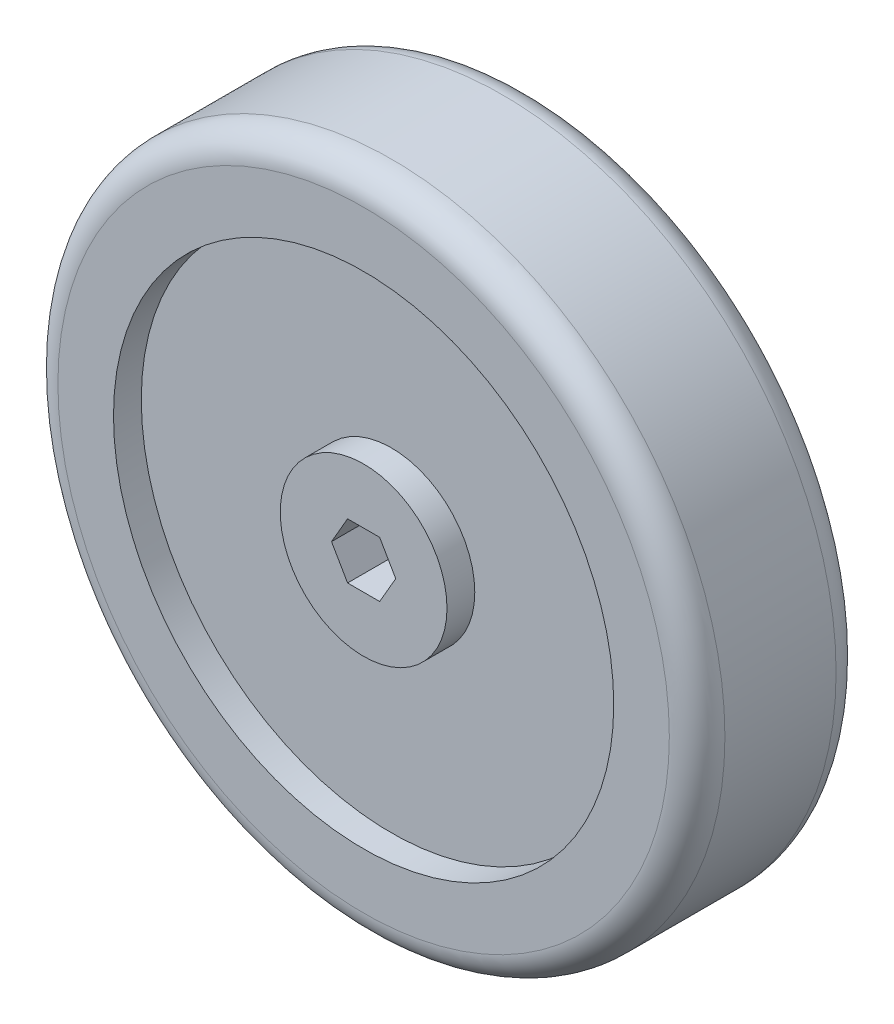
ISO-10303-21;
HEADER;
FILE_DESCRIPTION(('STEP AP214'),'2;1');
FILE_NAME('part.step','',(''),(''),'','','');
FILE_SCHEMA(('AUTOMOTIVE_DESIGN { 1 0 10303 214 1 1 1 1 }'));
ENDSEC;
DATA;
#1=APPLICATION_CONTEXT('core data for automotive mechanical design processes');
#2=APPLICATION_PROTOCOL_DEFINITION('international standard','automotive_design',2000,#1);
#3=PRODUCT_CONTEXT('',#1,'mechanical');
#4=PRODUCT('Part','Part','',(#3));
#5=PRODUCT_RELATED_PRODUCT_CATEGORY('part','',(#4));
#6=PRODUCT_DEFINITION_FORMATION('','',#4);
#7=PRODUCT_DEFINITION_CONTEXT('part definition',#1,'design');
#8=PRODUCT_DEFINITION('design','',#6,#7);
#9=PRODUCT_DEFINITION_SHAPE('','',#8);
#10=(LENGTH_UNIT() NAMED_UNIT(*) SI_UNIT(.MILLI.,.METRE.));
#11=(NAMED_UNIT(*) PLANE_ANGLE_UNIT() SI_UNIT($,.RADIAN.));
#12=(NAMED_UNIT(*) SI_UNIT($,.STERADIAN.) SOLID_ANGLE_UNIT());
#13=UNCERTAINTY_MEASURE_WITH_UNIT(LENGTH_MEASURE(1.E-05),#10,'distance_accuracy_value','');
#14=(GEOMETRIC_REPRESENTATION_CONTEXT(3) GLOBAL_UNCERTAINTY_ASSIGNED_CONTEXT((#13)) GLOBAL_UNIT_ASSIGNED_CONTEXT((#10,
#11,#12)) REPRESENTATION_CONTEXT('',''));
#15=CARTESIAN_POINT('',(0.,0.,0.));
#16=DIRECTION('',(0.,0.,1.));
#17=DIRECTION('',(1.,0.,0.));
#18=AXIS2_PLACEMENT_3D('',#15,#16,#17);
#19=CARTESIAN_POINT('',(0.,0.,0.));
#20=DIRECTION('',(0.,0.,1.));
#21=DIRECTION('',(1.,0.,0.));
#22=AXIS2_PLACEMENT_3D('',#19,#20,#21);
#23=PLANE('',#22);
#24=DIRECTION('',(1.,0.,0.));
#25=VECTOR('',#24,1.);
#26=CARTESIAN_POINT('',(-3.66617420935413,-6.35000000000001,0.));
#27=LINE('',#26,#25);
#28=CARTESIAN_POINT('',(-3.66617420935413,-6.35000000000001,0.));
#29=VERTEX_POINT('',#28);
#30=CARTESIAN_POINT('',(3.66617420935413,-6.35000000000001,0.));
#31=VERTEX_POINT('',#30);
#32=EDGE_CURVE('E95',#29,#31,#27,.T.);
#33=ORIENTED_EDGE('',*,*,#32,.T.);
#34=DIRECTION('',(0.5,0.866025403784439,0.));
#35=VECTOR('',#34,1.);
#36=CARTESIAN_POINT('',(3.66617420935413,-6.35000000000001,0.));
#37=LINE('',#36,#35);
#38=CARTESIAN_POINT('',(7.33234841870825,0.,0.));
#39=VERTEX_POINT('',#38);
#40=EDGE_CURVE('E89',#31,#39,#37,.T.);
#41=ORIENTED_EDGE('',*,*,#40,.T.);
#42=DIRECTION('',(-0.5,0.866025403784439,0.));
#43=VECTOR('',#42,1.);
#44=CARTESIAN_POINT('',(7.33234841870825,0.,0.));
#45=LINE('',#44,#43);
#46=CARTESIAN_POINT('',(3.66617420935412,6.35000000000001,0.));
#47=VERTEX_POINT('',#46);
#48=EDGE_CURVE('E98',#39,#47,#45,.T.);
#49=ORIENTED_EDGE('',*,*,#48,.T.);
#50=DIRECTION('',(-1.,0.,0.));
#51=VECTOR('',#50,1.);
#52=CARTESIAN_POINT('',(3.66617420935412,6.35000000000001,0.));
#53=LINE('',#52,#51);
#54=CARTESIAN_POINT('',(-3.66617420935413,6.35000000000001,0.));
#55=VERTEX_POINT('',#54);
#56=EDGE_CURVE('E57',#47,#55,#53,.T.);
#57=ORIENTED_EDGE('',*,*,#56,.T.);
#58=DIRECTION('',(-0.5,-0.866025403784439,0.));
#59=VECTOR('',#58,1.);
#60=CARTESIAN_POINT('',(-3.66617420935413,6.35000000000001,0.));
#61=LINE('',#60,#59);
#62=CARTESIAN_POINT('',(-7.33234841870826,0.,0.));
#63=VERTEX_POINT('',#62);
#64=EDGE_CURVE('E115',#55,#63,#61,.T.);
#65=ORIENTED_EDGE('',*,*,#64,.T.);
#66=DIRECTION('',(0.5,-0.866025403784439,0.));
#67=VECTOR('',#66,1.);
#68=CARTESIAN_POINT('',(-7.33234841870826,0.,0.));
#69=LINE('',#68,#67);
#70=EDGE_CURVE('E118',#63,#29,#69,.T.);
#71=ORIENTED_EDGE('',*,*,#70,.T.);
#72=EDGE_LOOP('',(#33,#41,#49,#57,#65,#71));
#73=FACE_BOUND('',#72,.T.);
#74=CARTESIAN_POINT('',(0.,0.,0.));
#75=DIRECTION('',(0.,0.,1.));
#76=DIRECTION('',(1.,0.,0.));
#77=AXIS2_PLACEMENT_3D('',#74,#75,#76);
#78=CIRCLE('',#77,19.05);
#79=CARTESIAN_POINT('',(19.05,0.,0.));
#80=VERTEX_POINT('',#79);
#81=EDGE_CURVE('E348',#80,#80,#78,.T.);
#82=ORIENTED_EDGE('',*,*,#81,.F.);
#83=EDGE_LOOP('',(#82));
#84=FACE_BOUND('',#83,.T.);
#85=ADVANCED_FACE('F34',(#73,#84),#23,.F.);
#86=CARTESIAN_POINT('',(0.,0.,38.1));
#87=DIRECTION('',(0.,0.,1.));
#88=DIRECTION('',(1.,0.,0.));
#89=AXIS2_PLACEMENT_3D('',#86,#87,#88);
#90=PLANE('',#89);
#91=DIRECTION('',(0.5,0.866025403784439,0.));
#92=VECTOR('',#91,1.);
#93=CARTESIAN_POINT('',(3.66617420935413,-6.35000000000001,38.1));
#94=LINE('',#93,#92);
#95=CARTESIAN_POINT('',(3.66617420935413,-6.35000000000001,38.1));
#96=VERTEX_POINT('',#95);
#97=CARTESIAN_POINT('',(7.33234841870825,0.,38.1));
#98=VERTEX_POINT('',#97);
#99=EDGE_CURVE('E49',#96,#98,#94,.T.);
#100=ORIENTED_EDGE('',*,*,#99,.F.);
#101=DIRECTION('',(1.,0.,0.));
#102=VECTOR('',#101,1.);
#103=CARTESIAN_POINT('',(-3.66617420935413,-6.35000000000001,38.1));
#104=LINE('',#103,#102);
#105=CARTESIAN_POINT('',(-3.66617420935413,-6.35000000000001,38.1));
#106=VERTEX_POINT('',#105);
#107=EDGE_CURVE('E105',#106,#96,#104,.T.);
#108=ORIENTED_EDGE('',*,*,#107,.F.);
#109=DIRECTION('',(0.5,-0.866025403784439,0.));
#110=VECTOR('',#109,1.);
#111=CARTESIAN_POINT('',(-7.33234841870826,0.,38.1));
#112=LINE('',#111,#110);
#113=CARTESIAN_POINT('',(-7.33234841870826,0.,38.1));
#114=VERTEX_POINT('',#113);
#115=EDGE_CURVE('E108',#114,#106,#112,.T.);
#116=ORIENTED_EDGE('',*,*,#115,.F.);
#117=DIRECTION('',(-0.5,-0.866025403784439,0.));
#118=VECTOR('',#117,1.);
#119=CARTESIAN_POINT('',(-3.66617420935413,6.35000000000001,38.1));
#120=LINE('',#119,#118);
#121=CARTESIAN_POINT('',(-3.66617420935413,6.35000000000001,38.1));
#122=VERTEX_POINT('',#121);
#123=EDGE_CURVE('E128',#122,#114,#120,.T.);
#124=ORIENTED_EDGE('',*,*,#123,.F.);
#125=DIRECTION('',(-1.,0.,0.));
#126=VECTOR('',#125,1.);
#127=CARTESIAN_POINT('',(3.66617420935412,6.35000000000001,38.1));
#128=LINE('',#127,#126);
#129=CARTESIAN_POINT('',(3.66617420935412,6.35000000000001,38.1));
#130=VERTEX_POINT('',#129);
#131=EDGE_CURVE('E125',#130,#122,#128,.T.);
#132=ORIENTED_EDGE('',*,*,#131,.F.);
#133=DIRECTION('',(-0.5,0.866025403784439,0.));
#134=VECTOR('',#133,1.);
#135=CARTESIAN_POINT('',(7.33234841870825,0.,38.1));
#136=LINE('',#135,#134);
#137=EDGE_CURVE('E122',#98,#130,#136,.T.);
#138=ORIENTED_EDGE('',*,*,#137,.F.);
#139=EDGE_LOOP('',(#100,#108,#116,#124,#132,#138));
#140=FACE_BOUND('',#139,.T.);
#141=CARTESIAN_POINT('',(0.,0.,38.1));
#142=DIRECTION('',(0.,0.,1.));
#143=DIRECTION('',(1.,0.,0.));
#144=AXIS2_PLACEMENT_3D('',#141,#142,#143);
#145=CIRCLE('',#144,19.05);
#146=CARTESIAN_POINT('',(19.05,0.,38.1));
#147=VERTEX_POINT('',#146);
#148=EDGE_CURVE('E356',#147,#147,#145,.T.);
#149=ORIENTED_EDGE('',*,*,#148,.T.);
#150=EDGE_LOOP('',(#149));
#151=FACE_BOUND('',#150,.T.);
#152=ADVANCED_FACE('F161',(#140,#151),#90,.T.);
#153=CARTESIAN_POINT('',(0.,0.,38.1));
#154=DIRECTION('',(0.,0.,-1.));
#155=DIRECTION('',(-1.,0.,0.));
#156=AXIS2_PLACEMENT_3D('',#153,#154,#155);
#157=CYLINDRICAL_SURFACE('',#156,76.2);
#158=CARTESIAN_POINT('',(0.,0.,6.35));
#159=DIRECTION('',(0.,0.,1.));
#160=DIRECTION('',(1.,0.,0.));
#161=AXIS2_PLACEMENT_3D('',#158,#159,#160);
#162=CIRCLE('',#161,76.2);
#163=CARTESIAN_POINT('',(76.2,0.,6.35));
#164=VERTEX_POINT('',#163);
#165=EDGE_CURVE('E145',#164,#164,#162,.T.);
#166=ORIENTED_EDGE('',*,*,#165,.T.);
#167=EDGE_LOOP('',(#166));
#168=FACE_BOUND('',#167,.T.);
#169=CARTESIAN_POINT('',(0.,0.,31.75));
#170=DIRECTION('',(0.,0.,1.));
#171=DIRECTION('',(1.,0.,0.));
#172=AXIS2_PLACEMENT_3D('',#169,#170,#171);
#173=CIRCLE('',#172,76.2);
#174=CARTESIAN_POINT('',(76.2,0.,31.75));
#175=VERTEX_POINT('',#174);
#176=EDGE_CURVE('E135',#175,#175,#173,.F.);
#177=ORIENTED_EDGE('',*,*,#176,.T.);
#178=EDGE_LOOP('',(#177));
#179=FACE_BOUND('',#178,.T.);
#180=ADVANCED_FACE('F157',(#168,#179),#157,.T.);
#181=CARTESIAN_POINT('',(0.,0.,38.1));
#182=DIRECTION('',(0.,0.,1.));
#183=DIRECTION('',(1.,0.,0.));
#184=AXIS2_PLACEMENT_3D('',#181,#182,#183);
#185=CIRCLE('',#184,57.15);
#186=CARTESIAN_POINT('',(57.15,0.,38.1));
#187=VERTEX_POINT('',#186);
#188=EDGE_CURVE('E111',#187,#187,#185,.T.);
#189=ORIENTED_EDGE('',*,*,#188,.F.);
#190=EDGE_LOOP('',(#189));
#191=FACE_BOUND('',#190,.T.);
#192=CARTESIAN_POINT('',(0.,0.,38.1));
#193=DIRECTION('',(0.,0.,1.));
#194=DIRECTION('',(1.,0.,0.));
#195=AXIS2_PLACEMENT_3D('',#192,#193,#194);
#196=CIRCLE('',#195,69.85);
#197=CARTESIAN_POINT('',(69.85,0.,38.1));
#198=VERTEX_POINT('',#197);
#199=EDGE_CURVE('E11',#198,#198,#196,.T.);
#200=ORIENTED_EDGE('',*,*,#199,.T.);
#201=EDGE_LOOP('',(#200));
#202=FACE_BOUND('',#201,.T.);
#203=ADVANCED_FACE('F160',(#191,#202),#90,.T.);
#204=CARTESIAN_POINT('',(0.,0.,0.));
#205=DIRECTION('',(0.,0.,1.));
#206=DIRECTION('',(1.,0.,0.));
#207=AXIS2_PLACEMENT_3D('',#204,#205,#206);
#208=CIRCLE('',#207,57.15);
#209=CARTESIAN_POINT('',(57.15,0.,0.));
#210=VERTEX_POINT('',#209);
#211=EDGE_CURVE('E350',#210,#210,#208,.T.);
#212=ORIENTED_EDGE('',*,*,#211,.T.);
#213=EDGE_LOOP('',(#212));
#214=FACE_BOUND('',#213,.T.);
#215=CARTESIAN_POINT('',(0.,0.,0.));
#216=DIRECTION('',(0.,0.,1.));
#217=DIRECTION('',(1.,0.,0.));
#218=AXIS2_PLACEMENT_3D('',#215,#216,#217);
#219=CIRCLE('',#218,69.85);
#220=CARTESIAN_POINT('',(69.85,0.,0.));
#221=VERTEX_POINT('',#220);
#222=EDGE_CURVE('E42',#221,#221,#219,.F.);
#223=ORIENTED_EDGE('',*,*,#222,.T.);
#224=EDGE_LOOP('',(#223));
#225=FACE_BOUND('',#224,.T.);
#226=ADVANCED_FACE('F150',(#214,#225),#23,.F.);
#227=CARTESIAN_POINT('',(0.,0.,6.35));
#228=DIRECTION('',(0.,0.,1.));
#229=DIRECTION('',(1.,0.,0.));
#230=AXIS2_PLACEMENT_3D('',#227,#228,#229);
#231=TOROIDAL_SURFACE('',#230,69.85,6.35);
#232=ORIENTED_EDGE('',*,*,#222,.F.);
#233=EDGE_LOOP('',(#232));
#234=FACE_BOUND('',#233,.T.);
#235=ORIENTED_EDGE('',*,*,#165,.F.);
#236=EDGE_LOOP('',(#235));
#237=FACE_BOUND('',#236,.T.);
#238=ADVANCED_FACE('F152',(#234,#237),#231,.T.);
#239=CARTESIAN_POINT('',(0.,0.,31.75));
#240=DIRECTION('',(0.,0.,1.));
#241=DIRECTION('',(1.,0.,0.));
#242=AXIS2_PLACEMENT_3D('',#239,#240,#241);
#243=TOROIDAL_SURFACE('',#242,69.85,6.35);
#244=ORIENTED_EDGE('',*,*,#176,.F.);
#245=EDGE_LOOP('',(#244));
#246=FACE_BOUND('',#245,.T.);
#247=ORIENTED_EDGE('',*,*,#199,.F.);
#248=EDGE_LOOP('',(#247));
#249=FACE_BOUND('',#248,.T.);
#250=ADVANCED_FACE('F36',(#246,#249),#243,.T.);
#251=CARTESIAN_POINT('',(3.66617420935413,-6.35000000000001,0.));
#252=DIRECTION('',(0.866025403784439,-0.5,0.));
#253=DIRECTION('',(0.5,0.866025403784439,0.));
#254=AXIS2_PLACEMENT_3D('',#251,#252,#253);
#255=PLANE('',#254);
#256=ORIENTED_EDGE('',*,*,#99,.T.);
#257=DIRECTION('',(0.,0.,1.));
#258=VECTOR('',#257,1.);
#259=CARTESIAN_POINT('',(7.33234841870825,0.,0.));
#260=LINE('',#259,#258);
#261=EDGE_CURVE('E85',#39,#98,#260,.T.);
#262=ORIENTED_EDGE('',*,*,#261,.F.);
#263=ORIENTED_EDGE('',*,*,#40,.F.);
#264=DIRECTION('',(0.,0.,1.));
#265=VECTOR('',#264,1.);
#266=CARTESIAN_POINT('',(3.66617420935413,-6.35000000000001,0.));
#267=LINE('',#266,#265);
#268=EDGE_CURVE('E133',#31,#96,#267,.T.);
#269=ORIENTED_EDGE('',*,*,#268,.T.);
#270=EDGE_LOOP('',(#256,#262,#263,#269));
#271=FACE_BOUND('',#270,.T.);
#272=ADVANCED_FACE('F87',(#271),#255,.F.);
#273=CARTESIAN_POINT('',(-3.66617420935413,-6.35000000000001,0.));
#274=DIRECTION('',(0.,-1.,0.));
#275=DIRECTION('',(1.,0.,0.));
#276=AXIS2_PLACEMENT_3D('',#273,#274,#275);
#277=PLANE('',#276);
#278=ORIENTED_EDGE('',*,*,#107,.T.);
#279=ORIENTED_EDGE('',*,*,#268,.F.);
#280=ORIENTED_EDGE('',*,*,#32,.F.);
#281=DIRECTION('',(0.,0.,1.));
#282=VECTOR('',#281,1.);
#283=CARTESIAN_POINT('',(-3.66617420935413,-6.35000000000001,0.));
#284=LINE('',#283,#282);
#285=EDGE_CURVE('E136',#29,#106,#284,.T.);
#286=ORIENTED_EDGE('',*,*,#285,.T.);
#287=EDGE_LOOP('',(#278,#279,#280,#286));
#288=FACE_BOUND('',#287,.T.);
#289=ADVANCED_FACE('F218',(#288),#277,.F.);
#290=CARTESIAN_POINT('',(-7.33234841870826,0.,0.));
#291=DIRECTION('',(-0.866025403784439,-0.5,0.));
#292=DIRECTION('',(0.5,-0.866025403784439,0.));
#293=AXIS2_PLACEMENT_3D('',#290,#291,#292);
#294=PLANE('',#293);
#295=ORIENTED_EDGE('',*,*,#115,.T.);
#296=ORIENTED_EDGE('',*,*,#285,.F.);
#297=ORIENTED_EDGE('',*,*,#70,.F.);
#298=DIRECTION('',(0.,0.,1.));
#299=VECTOR('',#298,1.);
#300=CARTESIAN_POINT('',(-7.33234841870826,0.,0.));
#301=LINE('',#300,#299);
#302=EDGE_CURVE('E138',#63,#114,#301,.T.);
#303=ORIENTED_EDGE('',*,*,#302,.T.);
#304=EDGE_LOOP('',(#295,#296,#297,#303));
#305=FACE_BOUND('',#304,.T.);
#306=ADVANCED_FACE('F226',(#305),#294,.F.);
#307=CARTESIAN_POINT('',(-3.66617420935413,6.35000000000001,0.));
#308=DIRECTION('',(-0.866025403784439,0.5,0.));
#309=DIRECTION('',(-0.5,-0.866025403784439,0.));
#310=AXIS2_PLACEMENT_3D('',#307,#308,#309);
#311=PLANE('',#310);
#312=ORIENTED_EDGE('',*,*,#123,.T.);
#313=ORIENTED_EDGE('',*,*,#302,.F.);
#314=ORIENTED_EDGE('',*,*,#64,.F.);
#315=DIRECTION('',(0.,0.,1.));
#316=VECTOR('',#315,1.);
#317=CARTESIAN_POINT('',(-3.66617420935413,6.35000000000001,0.));
#318=LINE('',#317,#316);
#319=EDGE_CURVE('E140',#55,#122,#318,.T.);
#320=ORIENTED_EDGE('',*,*,#319,.T.);
#321=EDGE_LOOP('',(#312,#313,#314,#320));
#322=FACE_BOUND('',#321,.T.);
#323=ADVANCED_FACE('F236',(#322),#311,.F.);
#324=CARTESIAN_POINT('',(3.66617420935412,6.35000000000001,0.));
#325=DIRECTION('',(0.,1.,0.));
#326=DIRECTION('',(-1.,0.,0.));
#327=AXIS2_PLACEMENT_3D('',#324,#325,#326);
#328=PLANE('',#327);
#329=ORIENTED_EDGE('',*,*,#131,.T.);
#330=ORIENTED_EDGE('',*,*,#319,.F.);
#331=ORIENTED_EDGE('',*,*,#56,.F.);
#332=DIRECTION('',(0.,0.,1.));
#333=VECTOR('',#332,1.);
#334=CARTESIAN_POINT('',(3.66617420935412,6.35000000000001,0.));
#335=LINE('',#334,#333);
#336=EDGE_CURVE('E94',#47,#130,#335,.T.);
#337=ORIENTED_EDGE('',*,*,#336,.T.);
#338=EDGE_LOOP('',(#329,#330,#331,#337));
#339=FACE_BOUND('',#338,.T.);
#340=ADVANCED_FACE('F246',(#339),#328,.F.);
#341=CARTESIAN_POINT('',(7.33234841870825,0.,0.));
#342=DIRECTION('',(0.866025403784439,0.5,0.));
#343=DIRECTION('',(-0.5,0.866025403784439,0.));
#344=AXIS2_PLACEMENT_3D('',#341,#342,#343);
#345=PLANE('',#344);
#346=ORIENTED_EDGE('',*,*,#137,.T.);
#347=ORIENTED_EDGE('',*,*,#336,.F.);
#348=ORIENTED_EDGE('',*,*,#48,.F.);
#349=ORIENTED_EDGE('',*,*,#261,.T.);
#350=EDGE_LOOP('',(#346,#347,#348,#349));
#351=FACE_BOUND('',#350,.T.);
#352=ADVANCED_FACE('F99',(#351),#345,.F.);
#353=CARTESIAN_POINT('',(0.,0.,31.75));
#354=DIRECTION('',(0.,0.,1.));
#355=DIRECTION('',(1.,0.,0.));
#356=AXIS2_PLACEMENT_3D('',#353,#354,#355);
#357=CYLINDRICAL_SURFACE('',#356,57.15);
#358=CARTESIAN_POINT('',(0.,0.,31.75));
#359=DIRECTION('',(0.,0.,1.));
#360=DIRECTION('',(1.,0.,0.));
#361=AXIS2_PLACEMENT_3D('',#358,#359,#360);
#362=CIRCLE('',#361,57.15);
#363=CARTESIAN_POINT('',(57.15,0.,31.75));
#364=VERTEX_POINT('',#363);
#365=EDGE_CURVE('E123',#364,#364,#362,.T.);
#366=ORIENTED_EDGE('',*,*,#365,.F.);
#367=EDGE_LOOP('',(#366));
#368=FACE_BOUND('',#367,.T.);
#369=ORIENTED_EDGE('',*,*,#188,.T.);
#370=EDGE_LOOP('',(#369));
#371=FACE_BOUND('',#370,.T.);
#372=ADVANCED_FACE('F262',(#368,#371),#357,.F.);
#373=CARTESIAN_POINT('',(0.,0.,31.75));
#374=DIRECTION('',(0.,0.,1.));
#375=DIRECTION('',(1.,0.,0.));
#376=AXIS2_PLACEMENT_3D('',#373,#374,#375);
#377=PLANE('',#376);
#378=CARTESIAN_POINT('',(0.,0.,31.75));
#379=DIRECTION('',(0.,0.,1.));
#380=DIRECTION('',(1.,0.,0.));
#381=AXIS2_PLACEMENT_3D('',#378,#379,#380);
#382=CIRCLE('',#381,19.05);
#383=CARTESIAN_POINT('',(19.05,0.,31.75));
#384=VERTEX_POINT('',#383);
#385=EDGE_CURVE('E359',#384,#384,#382,.T.);
#386=ORIENTED_EDGE('',*,*,#385,.F.);
#387=EDGE_LOOP('',(#386));
#388=FACE_BOUND('',#387,.T.);
#389=ORIENTED_EDGE('',*,*,#365,.T.);
#390=EDGE_LOOP('',(#389));
#391=FACE_BOUND('',#390,.T.);
#392=ADVANCED_FACE('F271',(#388,#391),#377,.T.);
#393=CARTESIAN_POINT('',(0.,0.,31.75));
#394=DIRECTION('',(0.,0.,1.));
#395=DIRECTION('',(1.,0.,0.));
#396=AXIS2_PLACEMENT_3D('',#393,#394,#395);
#397=CYLINDRICAL_SURFACE('',#396,19.05);
#398=ORIENTED_EDGE('',*,*,#385,.T.);
#399=EDGE_LOOP('',(#398));
#400=FACE_BOUND('',#399,.T.);
#401=ORIENTED_EDGE('',*,*,#148,.F.);
#402=EDGE_LOOP('',(#401));
#403=FACE_BOUND('',#402,.T.);
#404=ADVANCED_FACE('F279',(#400,#403),#397,.T.);
#405=CARTESIAN_POINT('',(0.,0.,6.35));
#406=DIRECTION('',(0.,0.,-1.));
#407=DIRECTION('',(1.,0.,0.));
#408=AXIS2_PLACEMENT_3D('',#405,#406,#407);
#409=PLANE('',#408);
#410=CARTESIAN_POINT('',(0.,0.,6.35));
#411=DIRECTION('',(0.,0.,1.));
#412=DIRECTION('',(1.,0.,0.));
#413=AXIS2_PLACEMENT_3D('',#410,#411,#412);
#414=CIRCLE('',#413,57.15);
#415=CARTESIAN_POINT('',(57.15,0.,6.35));
#416=VERTEX_POINT('',#415);
#417=EDGE_CURVE('E353',#416,#416,#414,.T.);
#418=ORIENTED_EDGE('',*,*,#417,.F.);
#419=EDGE_LOOP('',(#418));
#420=FACE_BOUND('',#419,.T.);
#421=CARTESIAN_POINT('',(0.,0.,6.35));
#422=DIRECTION('',(0.,0.,1.));
#423=DIRECTION('',(1.,0.,0.));
#424=AXIS2_PLACEMENT_3D('',#421,#422,#423);
#425=CIRCLE('',#424,19.05);
#426=CARTESIAN_POINT('',(19.05,0.,6.35));
#427=VERTEX_POINT('',#426);
#428=EDGE_CURVE('E345',#427,#427,#425,.T.);
#429=ORIENTED_EDGE('',*,*,#428,.T.);
#430=EDGE_LOOP('',(#429));
#431=FACE_BOUND('',#430,.T.);
#432=ADVANCED_FACE('F286',(#420,#431),#409,.T.);
#433=CARTESIAN_POINT('',(0.,0.,6.35));
#434=DIRECTION('',(0.,0.,-1.));
#435=DIRECTION('',(-1.,0.,0.));
#436=AXIS2_PLACEMENT_3D('',#433,#434,#435);
#437=CYLINDRICAL_SURFACE('',#436,57.15);
#438=ORIENTED_EDGE('',*,*,#417,.T.);
#439=EDGE_LOOP('',(#438));
#440=FACE_BOUND('',#439,.T.);
#441=ORIENTED_EDGE('',*,*,#211,.F.);
#442=EDGE_LOOP('',(#441));
#443=FACE_BOUND('',#442,.T.);
#444=ADVANCED_FACE('F294',(#440,#443),#437,.F.);
#445=CARTESIAN_POINT('',(0.,0.,6.35));
#446=DIRECTION('',(0.,0.,-1.));
#447=DIRECTION('',(-1.,0.,0.));
#448=AXIS2_PLACEMENT_3D('',#445,#446,#447);
#449=CYLINDRICAL_SURFACE('',#448,19.05);
#450=ORIENTED_EDGE('',*,*,#428,.F.);
#451=EDGE_LOOP('',(#450));
#452=FACE_BOUND('',#451,.T.);
#453=ORIENTED_EDGE('',*,*,#81,.T.);
#454=EDGE_LOOP('',(#453));
#455=FACE_BOUND('',#454,.T.);
#456=ADVANCED_FACE('F303',(#452,#455),#449,.T.);
#457=CLOSED_SHELL('',(#85,#152,#180,#203,#226,#238,#250,#272,#289,#306,#323,#340,#352,#372,#392,
#404,#432,#444,#456));
#458=MANIFOLD_SOLID_BREP('B2',#457);
#459=ADVANCED_BREP_SHAPE_REPRESENTATION('',(#18,#458),#14);
#460=SHAPE_DEFINITION_REPRESENTATION(#9,#459);
ENDSEC;
END-ISO-10303-21;
